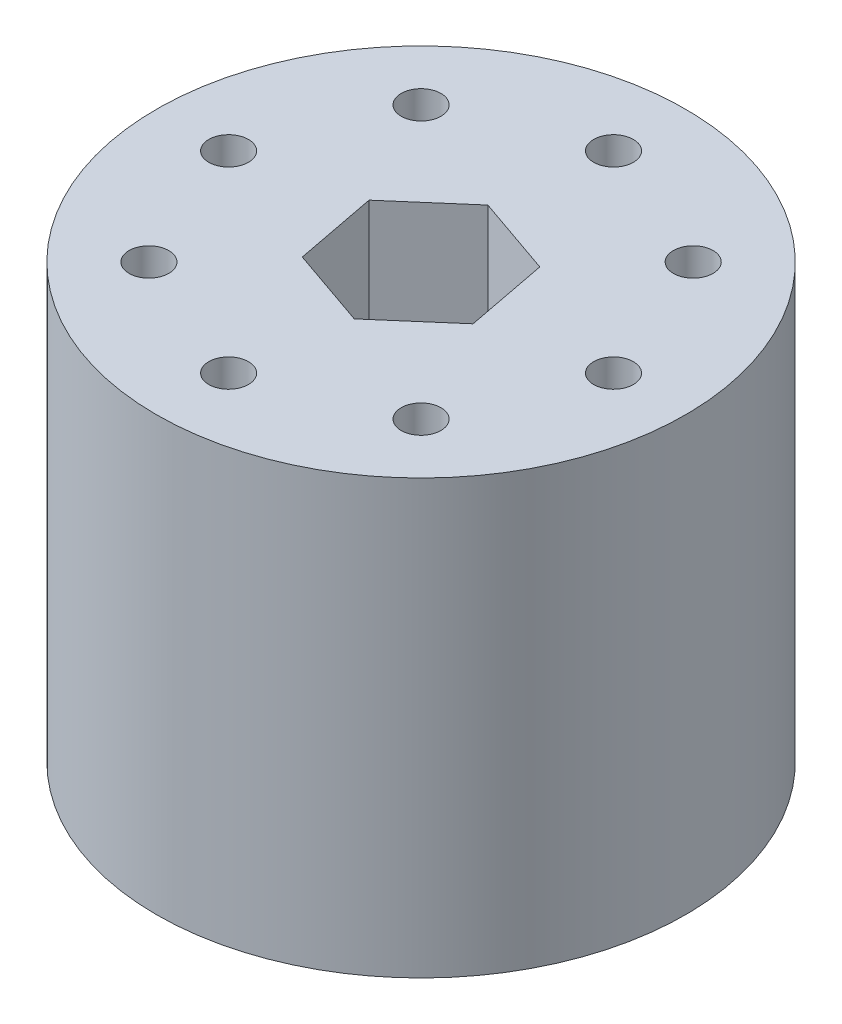
ISO-10303-21;
HEADER;
FILE_DESCRIPTION(('STEP AP214'),'2;1');
FILE_NAME('part.step','',(''),(''),'','','');
FILE_SCHEMA(('AUTOMOTIVE_DESIGN { 1 0 10303 214 1 1 1 1 }'));
ENDSEC;
DATA;
#1=APPLICATION_CONTEXT('core data for automotive mechanical design processes');
#2=APPLICATION_PROTOCOL_DEFINITION('international standard','automotive_design',2000,#1);
#3=PRODUCT_CONTEXT('',#1,'mechanical');
#4=PRODUCT('Part','Part','',(#3));
#5=PRODUCT_RELATED_PRODUCT_CATEGORY('part','',(#4));
#6=PRODUCT_DEFINITION_FORMATION('','',#4);
#7=PRODUCT_DEFINITION_CONTEXT('part definition',#1,'design');
#8=PRODUCT_DEFINITION('design','',#6,#7);
#9=PRODUCT_DEFINITION_SHAPE('','',#8);
#10=(LENGTH_UNIT() NAMED_UNIT(*) SI_UNIT(.MILLI.,.METRE.));
#11=(NAMED_UNIT(*) PLANE_ANGLE_UNIT() SI_UNIT($,.RADIAN.));
#12=(NAMED_UNIT(*) SI_UNIT($,.STERADIAN.) SOLID_ANGLE_UNIT());
#13=UNCERTAINTY_MEASURE_WITH_UNIT(LENGTH_MEASURE(1.E-05),#10,'distance_accuracy_value','');
#14=(GEOMETRIC_REPRESENTATION_CONTEXT(3) GLOBAL_UNCERTAINTY_ASSIGNED_CONTEXT((#13)) GLOBAL_UNIT_ASSIGNED_CONTEXT((#10,
#11,#12)) REPRESENTATION_CONTEXT('',''));
#15=CARTESIAN_POINT('',(0.,0.,0.));
#16=DIRECTION('',(0.,0.,1.));
#17=DIRECTION('',(1.,0.,0.));
#18=AXIS2_PLACEMENT_3D('',#15,#16,#17);
#19=CARTESIAN_POINT('',(0.,-12.,0.));
#20=DIRECTION('',(0.,1.,0.));
#21=DIRECTION('',(0.,0.,1.));
#22=AXIS2_PLACEMENT_3D('',#19,#20,#21);
#23=CYLINDRICAL_SURFACE('',#22,2.3);
#24=CARTESIAN_POINT('',(0.,26.,0.));
#25=DIRECTION('',(0.,1.,0.));
#26=DIRECTION('',(0.,0.,1.));
#27=AXIS2_PLACEMENT_3D('',#24,#25,#26);
#28=CIRCLE('',#27,2.3);
#29=CARTESIAN_POINT('',(0.,26.,2.3));
#30=VERTEX_POINT('',#29);
#31=EDGE_CURVE('E130',#30,#30,#28,.T.);
#32=ORIENTED_EDGE('',*,*,#31,.T.);
#33=EDGE_LOOP('',(#32));
#34=FACE_BOUND('',#33,.T.);
#35=CARTESIAN_POINT('',(0.,8.99999999999998,0.));
#36=DIRECTION('',(0.,-1.,0.));
#37=DIRECTION('',(0.,0.,-1.));
#38=AXIS2_PLACEMENT_3D('',#35,#36,#37);
#39=CIRCLE('',#38,2.3);
#40=CARTESIAN_POINT('',(0.,8.99999999999998,-2.3));
#41=VERTEX_POINT('',#40);
#42=EDGE_CURVE('E42',#41,#41,#39,.F.);
#43=ORIENTED_EDGE('',*,*,#42,.F.);
#44=EDGE_LOOP('',(#43));
#45=FACE_BOUND('',#44,.T.);
#46=ADVANCED_FACE('F38',(#34,#45),#23,.F.);
#47=CARTESIAN_POINT('',(0.,36.,0.));
#48=DIRECTION('',(0.,-1.,0.));
#49=DIRECTION('',(0.,0.,-1.));
#50=AXIS2_PLACEMENT_3D('',#47,#48,#49);
#51=CYLINDRICAL_SURFACE('',#50,22.);
#52=CARTESIAN_POINT('',(0.,36.,0.));
#53=DIRECTION('',(0.,1.,0.));
#54=DIRECTION('',(0.,0.,1.));
#55=AXIS2_PLACEMENT_3D('',#52,#53,#54);
#56=CIRCLE('',#55,22.);
#57=CARTESIAN_POINT('',(0.,36.,22.));
#58=VERTEX_POINT('',#57);
#59=EDGE_CURVE('E11',#58,#58,#56,.T.);
#60=ORIENTED_EDGE('',*,*,#59,.F.);
#61=EDGE_LOOP('',(#60));
#62=FACE_BOUND('',#61,.T.);
#63=CARTESIAN_POINT('',(0.,0.,0.));
#64=DIRECTION('',(0.,1.,0.));
#65=DIRECTION('',(0.,0.,1.));
#66=AXIS2_PLACEMENT_3D('',#63,#64,#65);
#67=CIRCLE('',#66,22.);
#68=CARTESIAN_POINT('',(0.,0.,22.));
#69=VERTEX_POINT('',#68);
#70=EDGE_CURVE('E47',#69,#69,#67,.T.);
#71=ORIENTED_EDGE('',*,*,#70,.T.);
#72=EDGE_LOOP('',(#71));
#73=FACE_BOUND('',#72,.T.);
#74=ADVANCED_FACE('F40',(#62,#73),#51,.T.);
#75=CARTESIAN_POINT('',(0.,36.,0.));
#76=DIRECTION('',(0.,1.,0.));
#77=DIRECTION('',(0.,0.,1.));
#78=AXIS2_PLACEMENT_3D('',#75,#76,#77);
#79=PLANE('',#78);
#80=DIRECTION('',(0.944854855791401,0.,0.327489391412012));
#81=VECTOR('',#80,1.);
#82=CARTESIAN_POINT('',(-5.29229092229886,36.,4.58166528608901));
#83=LINE('',#82,#81);
#84=CARTESIAN_POINT('',(-5.29229092229886,36.,4.58166528608901));
#85=VERTEX_POINT('',#84);
#86=CARTESIAN_POINT('',(1.32169306824095,36.,6.87409102597309));
#87=VERTEX_POINT('',#86);
#88=EDGE_CURVE('E55',#85,#87,#83,.T.);
#89=ORIENTED_EDGE('',*,*,#88,.F.);
#90=DIRECTION('',(0.188813295462993,0.,0.982013003710442));
#91=VECTOR('',#90,1.);
#92=CARTESIAN_POINT('',(-6.61398399053981,36.,-2.29242573988408));
#93=LINE('',#92,#91);
#94=CARTESIAN_POINT('',(-6.61398399053981,36.,-2.29242573988408));
#95=VERTEX_POINT('',#94);
#96=EDGE_CURVE('E139',#95,#85,#93,.T.);
#97=ORIENTED_EDGE('',*,*,#96,.F.);
#98=DIRECTION('',(-0.756041560328408,0.,0.65452361229843));
#99=VECTOR('',#98,1.);
#100=CARTESIAN_POINT('',(-1.32169306824095,36.,-6.8740910259731));
#101=LINE('',#100,#99);
#102=CARTESIAN_POINT('',(-1.32169306824095,36.,-6.8740910259731));
#103=VERTEX_POINT('',#102);
#104=EDGE_CURVE('E137',#103,#95,#101,.T.);
#105=ORIENTED_EDGE('',*,*,#104,.F.);
#106=DIRECTION('',(-0.944854855791401,0.,-0.327489391412012));
#107=VECTOR('',#106,1.);
#108=CARTESIAN_POINT('',(5.29229092229886,36.,-4.58166528608901));
#109=LINE('',#108,#107);
#110=CARTESIAN_POINT('',(5.29229092229886,36.,-4.58166528608901));
#111=VERTEX_POINT('',#110);
#112=EDGE_CURVE('E103',#111,#103,#109,.T.);
#113=ORIENTED_EDGE('',*,*,#112,.F.);
#114=DIRECTION('',(-0.188813295462993,0.,-0.982013003710442));
#115=VECTOR('',#114,1.);
#116=CARTESIAN_POINT('',(6.61398399053981,36.,2.29242573988408));
#117=LINE('',#116,#115);
#118=CARTESIAN_POINT('',(6.61398399053981,36.,2.29242573988408));
#119=VERTEX_POINT('',#118);
#120=EDGE_CURVE('E133',#119,#111,#117,.T.);
#121=ORIENTED_EDGE('',*,*,#120,.F.);
#122=DIRECTION('',(0.756041560328408,0.,-0.65452361229843));
#123=VECTOR('',#122,1.);
#124=CARTESIAN_POINT('',(1.32169306824095,36.,6.87409102597309));
#125=LINE('',#124,#123);
#126=EDGE_CURVE('E129',#87,#119,#125,.T.);
#127=ORIENTED_EDGE('',*,*,#126,.F.);
#128=EDGE_LOOP('',(#89,#97,#105,#113,#121,#127));
#129=FACE_BOUND('',#128,.T.);
#130=CARTESIAN_POINT('',(0.,36.,-16.));
#131=DIRECTION('',(0.,1.,0.));
#132=DIRECTION('',(0.,0.,1.));
#133=AXIS2_PLACEMENT_3D('',#130,#131,#132);
#134=CIRCLE('',#133,1.65000000000085);
#135=CARTESIAN_POINT('',(0.,36.,-14.3499999999991));
#136=VERTEX_POINT('',#135);
#137=EDGE_CURVE('E171',#136,#136,#134,.T.);
#138=ORIENTED_EDGE('',*,*,#137,.F.);
#139=EDGE_LOOP('',(#138));
#140=FACE_BOUND('',#139,.T.);
#141=CARTESIAN_POINT('',(11.3137084989847,36.,-11.3137084989847));
#142=DIRECTION('',(0.,1.,0.));
#143=DIRECTION('',(0.,0.,1.));
#144=AXIS2_PLACEMENT_3D('',#141,#142,#143);
#145=CIRCLE('',#144,1.65000000000154);
#146=CARTESIAN_POINT('',(11.3137084989847,36.,-9.6637084989832));
#147=VERTEX_POINT('',#146);
#148=EDGE_CURVE('E177',#147,#147,#145,.T.);
#149=ORIENTED_EDGE('',*,*,#148,.F.);
#150=EDGE_LOOP('',(#149));
#151=FACE_BOUND('',#150,.T.);
#152=CARTESIAN_POINT('',(16.,36.,0.));
#153=DIRECTION('',(0.,1.,0.));
#154=DIRECTION('',(0.,0.,1.));
#155=AXIS2_PLACEMENT_3D('',#152,#153,#154);
#156=CIRCLE('',#155,1.6500000000012);
#157=CARTESIAN_POINT('',(16.,36.,1.6500000000012));
#158=VERTEX_POINT('',#157);
#159=EDGE_CURVE('E183',#158,#158,#156,.T.);
#160=ORIENTED_EDGE('',*,*,#159,.F.);
#161=EDGE_LOOP('',(#160));
#162=FACE_BOUND('',#161,.T.);
#163=CARTESIAN_POINT('',(11.3137084989856,36.,11.3137084989857));
#164=DIRECTION('',(0.,1.,0.));
#165=DIRECTION('',(0.,0.,1.));
#166=AXIS2_PLACEMENT_3D('',#163,#164,#165);
#167=CIRCLE('',#166,1.65000000000003);
#168=CARTESIAN_POINT('',(11.3137084989856,36.,12.9637084989858));
#169=VERTEX_POINT('',#168);
#170=EDGE_CURVE('E152',#169,#169,#167,.T.);
#171=ORIENTED_EDGE('',*,*,#170,.F.);
#172=EDGE_LOOP('',(#171));
#173=FACE_BOUND('',#172,.T.);
#174=CARTESIAN_POINT('',(9.05525654459922E-13,36.,16.000000000001));
#175=DIRECTION('',(0.,1.,0.));
#176=DIRECTION('',(0.,0.,1.));
#177=AXIS2_PLACEMENT_3D('',#174,#175,#176);
#178=CIRCLE('',#177,1.65);
#179=CARTESIAN_POINT('',(9.05525654459922E-13,36.,17.650000000001));
#180=VERTEX_POINT('',#179);
#181=EDGE_CURVE('E153',#180,#180,#178,.T.);
#182=ORIENTED_EDGE('',*,*,#181,.F.);
#183=EDGE_LOOP('',(#182));
#184=FACE_BOUND('',#183,.T.);
#185=CARTESIAN_POINT('',(-11.3137084989847,36.,11.3137084989847));
#186=DIRECTION('',(0.,1.,0.));
#187=DIRECTION('',(0.,0.,1.));
#188=AXIS2_PLACEMENT_3D('',#185,#186,#187);
#189=CIRCLE('',#188,1.64999999999989);
#190=CARTESIAN_POINT('',(-11.3137084989847,36.,12.9637084989846));
#191=VERTEX_POINT('',#190);
#192=EDGE_CURVE('E159',#191,#191,#189,.T.);
#193=ORIENTED_EDGE('',*,*,#192,.F.);
#194=EDGE_LOOP('',(#193));
#195=FACE_BOUND('',#194,.T.);
#196=CARTESIAN_POINT('',(-16.,36.,0.));
#197=DIRECTION('',(0.,1.,0.));
#198=DIRECTION('',(0.,0.,1.));
#199=AXIS2_PLACEMENT_3D('',#196,#197,#198);
#200=CIRCLE('',#199,1.65000000000023);
#201=CARTESIAN_POINT('',(-16.,36.,1.65000000000023));
#202=VERTEX_POINT('',#201);
#203=EDGE_CURVE('E143',#202,#202,#200,.T.);
#204=ORIENTED_EDGE('',*,*,#203,.F.);
#205=EDGE_LOOP('',(#204));
#206=FACE_BOUND('',#205,.T.);
#207=CARTESIAN_POINT('',(-11.3137084989847,36.,-11.3137084989847));
#208=DIRECTION('',(0.,1.,0.));
#209=DIRECTION('',(0.,0.,1.));
#210=AXIS2_PLACEMENT_3D('',#207,#208,#209);
#211=CIRCLE('',#210,1.65000000000082);
#212=CARTESIAN_POINT('',(-11.3137084989847,36.,-9.66370849898391));
#213=VERTEX_POINT('',#212);
#214=EDGE_CURVE('E170',#213,#213,#211,.T.);
#215=ORIENTED_EDGE('',*,*,#214,.F.);
#216=EDGE_LOOP('',(#215));
#217=FACE_BOUND('',#216,.T.);
#218=ORIENTED_EDGE('',*,*,#59,.T.);
#219=EDGE_LOOP('',(#218));
#220=FACE_BOUND('',#219,.T.);
#221=ADVANCED_FACE('F202',(#129,#140,#151,#162,#173,#184,#195,#206,#217,#220),#79,.T.);
#222=CARTESIAN_POINT('',(0.,0.,0.));
#223=DIRECTION('',(0.,1.,0.));
#224=DIRECTION('',(0.,0.,1.));
#225=AXIS2_PLACEMENT_3D('',#222,#223,#224);
#226=PLANE('',#225);
#227=CARTESIAN_POINT('',(0.,0.,0.));
#228=DIRECTION('',(0.,-1.,0.));
#229=DIRECTION('',(0.,0.,-1.));
#230=AXIS2_PLACEMENT_3D('',#227,#228,#229);
#231=CIRCLE('',#230,5.59540043034474);
#232=CARTESIAN_POINT('',(0.,0.,-5.59540043034474));
#233=VERTEX_POINT('',#232);
#234=EDGE_CURVE('E434',#233,#233,#231,.T.);
#235=ORIENTED_EDGE('',*,*,#234,.F.);
#236=EDGE_LOOP('',(#235));
#237=FACE_BOUND('',#236,.T.);
#238=CARTESIAN_POINT('',(0.,0.,-16.));
#239=DIRECTION('',(0.,1.,0.));
#240=DIRECTION('',(0.,0.,1.));
#241=AXIS2_PLACEMENT_3D('',#238,#239,#240);
#242=CIRCLE('',#241,1.65000000000085);
#243=CARTESIAN_POINT('',(0.,0.,-14.3499999999991));
#244=VERTEX_POINT('',#243);
#245=EDGE_CURVE('E167',#244,#244,#242,.T.);
#246=ORIENTED_EDGE('',*,*,#245,.T.);
#247=EDGE_LOOP('',(#246));
#248=FACE_BOUND('',#247,.T.);
#249=CARTESIAN_POINT('',(11.3137084989847,0.,-11.3137084989847));
#250=DIRECTION('',(0.,1.,0.));
#251=DIRECTION('',(0.,0.,1.));
#252=AXIS2_PLACEMENT_3D('',#249,#250,#251);
#253=CIRCLE('',#252,1.65000000000154);
#254=CARTESIAN_POINT('',(11.3137084989847,0.,-9.6637084989832));
#255=VERTEX_POINT('',#254);
#256=EDGE_CURVE('E174',#255,#255,#253,.T.);
#257=ORIENTED_EDGE('',*,*,#256,.T.);
#258=EDGE_LOOP('',(#257));
#259=FACE_BOUND('',#258,.T.);
#260=CARTESIAN_POINT('',(16.,0.,0.));
#261=DIRECTION('',(0.,1.,0.));
#262=DIRECTION('',(0.,0.,1.));
#263=AXIS2_PLACEMENT_3D('',#260,#261,#262);
#264=CIRCLE('',#263,1.6500000000012);
#265=CARTESIAN_POINT('',(16.,0.,1.6500000000012));
#266=VERTEX_POINT('',#265);
#267=EDGE_CURVE('E180',#266,#266,#264,.T.);
#268=ORIENTED_EDGE('',*,*,#267,.T.);
#269=EDGE_LOOP('',(#268));
#270=FACE_BOUND('',#269,.T.);
#271=CARTESIAN_POINT('',(11.3137084989856,0.,11.3137084989857));
#272=DIRECTION('',(0.,1.,0.));
#273=DIRECTION('',(0.,0.,1.));
#274=AXIS2_PLACEMENT_3D('',#271,#272,#273);
#275=CIRCLE('',#274,1.65000000000003);
#276=CARTESIAN_POINT('',(11.3137084989856,0.,12.9637084989858));
#277=VERTEX_POINT('',#276);
#278=EDGE_CURVE('E186',#277,#277,#275,.T.);
#279=ORIENTED_EDGE('',*,*,#278,.T.);
#280=EDGE_LOOP('',(#279));
#281=FACE_BOUND('',#280,.T.);
#282=CARTESIAN_POINT('',(9.05525654459922E-13,0.,16.000000000001));
#283=DIRECTION('',(0.,1.,0.));
#284=DIRECTION('',(0.,0.,1.));
#285=AXIS2_PLACEMENT_3D('',#282,#283,#284);
#286=CIRCLE('',#285,1.65);
#287=CARTESIAN_POINT('',(9.05525654459922E-13,0.,17.650000000001));
#288=VERTEX_POINT('',#287);
#289=EDGE_CURVE('E149',#288,#288,#286,.T.);
#290=ORIENTED_EDGE('',*,*,#289,.T.);
#291=EDGE_LOOP('',(#290));
#292=FACE_BOUND('',#291,.T.);
#293=CARTESIAN_POINT('',(-11.3137084989847,0.,11.3137084989847));
#294=DIRECTION('',(0.,1.,0.));
#295=DIRECTION('',(0.,0.,1.));
#296=AXIS2_PLACEMENT_3D('',#293,#294,#295);
#297=CIRCLE('',#296,1.64999999999989);
#298=CARTESIAN_POINT('',(-11.3137084989847,0.,12.9637084989846));
#299=VERTEX_POINT('',#298);
#300=EDGE_CURVE('E156',#299,#299,#297,.T.);
#301=ORIENTED_EDGE('',*,*,#300,.T.);
#302=EDGE_LOOP('',(#301));
#303=FACE_BOUND('',#302,.T.);
#304=CARTESIAN_POINT('',(-16.,0.,0.));
#305=DIRECTION('',(0.,1.,0.));
#306=DIRECTION('',(0.,0.,1.));
#307=AXIS2_PLACEMENT_3D('',#304,#305,#306);
#308=CIRCLE('',#307,1.65000000000023);
#309=CARTESIAN_POINT('',(-16.,0.,1.65000000000023));
#310=VERTEX_POINT('',#309);
#311=EDGE_CURVE('E162',#310,#310,#308,.T.);
#312=ORIENTED_EDGE('',*,*,#311,.T.);
#313=EDGE_LOOP('',(#312));
#314=FACE_BOUND('',#313,.T.);
#315=CARTESIAN_POINT('',(-11.3137084989847,0.,-11.3137084989847));
#316=DIRECTION('',(0.,1.,0.));
#317=DIRECTION('',(0.,0.,1.));
#318=AXIS2_PLACEMENT_3D('',#315,#316,#317);
#319=CIRCLE('',#318,1.65000000000082);
#320=CARTESIAN_POINT('',(-11.3137084989847,0.,-9.66370849898391));
#321=VERTEX_POINT('',#320);
#322=EDGE_CURVE('E191',#321,#321,#319,.T.);
#323=ORIENTED_EDGE('',*,*,#322,.T.);
#324=EDGE_LOOP('',(#323));
#325=FACE_BOUND('',#324,.T.);
#326=ORIENTED_EDGE('',*,*,#70,.F.);
#327=EDGE_LOOP('',(#326));
#328=FACE_BOUND('',#327,.T.);
#329=ADVANCED_FACE('F199',(#237,#248,#259,#270,#281,#292,#303,#314,#325,#328),#226,.F.);
#330=CARTESIAN_POINT('',(-11.3137084989847,0.,-11.3137084989847));
#331=DIRECTION('',(0.,1.,0.));
#332=DIRECTION('',(0.,0.,1.));
#333=AXIS2_PLACEMENT_3D('',#330,#331,#332);
#334=CYLINDRICAL_SURFACE('',#333,1.65000000000082);
#335=ORIENTED_EDGE('',*,*,#322,.F.);
#336=EDGE_LOOP('',(#335));
#337=FACE_BOUND('',#336,.T.);
#338=ORIENTED_EDGE('',*,*,#214,.T.);
#339=EDGE_LOOP('',(#338));
#340=FACE_BOUND('',#339,.T.);
#341=ADVANCED_FACE('F201',(#337,#340),#334,.F.);
#342=CARTESIAN_POINT('',(-16.,0.,0.));
#343=DIRECTION('',(0.,1.,0.));
#344=DIRECTION('',(0.,0.,1.));
#345=AXIS2_PLACEMENT_3D('',#342,#343,#344);
#346=CYLINDRICAL_SURFACE('',#345,1.65000000000023);
#347=ORIENTED_EDGE('',*,*,#311,.F.);
#348=EDGE_LOOP('',(#347));
#349=FACE_BOUND('',#348,.T.);
#350=ORIENTED_EDGE('',*,*,#203,.T.);
#351=EDGE_LOOP('',(#350));
#352=FACE_BOUND('',#351,.T.);
#353=ADVANCED_FACE('F209',(#349,#352),#346,.F.);
#354=CARTESIAN_POINT('',(-11.3137084989847,0.,11.3137084989847));
#355=DIRECTION('',(0.,1.,0.));
#356=DIRECTION('',(0.,0.,1.));
#357=AXIS2_PLACEMENT_3D('',#354,#355,#356);
#358=CYLINDRICAL_SURFACE('',#357,1.64999999999989);
#359=ORIENTED_EDGE('',*,*,#300,.F.);
#360=EDGE_LOOP('',(#359));
#361=FACE_BOUND('',#360,.T.);
#362=ORIENTED_EDGE('',*,*,#192,.T.);
#363=EDGE_LOOP('',(#362));
#364=FACE_BOUND('',#363,.T.);
#365=ADVANCED_FACE('F256',(#361,#364),#358,.F.);
#366=CARTESIAN_POINT('',(9.05525654459922E-13,0.,16.000000000001));
#367=DIRECTION('',(0.,1.,0.));
#368=DIRECTION('',(0.,0.,1.));
#369=AXIS2_PLACEMENT_3D('',#366,#367,#368);
#370=CYLINDRICAL_SURFACE('',#369,1.65);
#371=ORIENTED_EDGE('',*,*,#289,.F.);
#372=EDGE_LOOP('',(#371));
#373=FACE_BOUND('',#372,.T.);
#374=ORIENTED_EDGE('',*,*,#181,.T.);
#375=EDGE_LOOP('',(#374));
#376=FACE_BOUND('',#375,.T.);
#377=ADVANCED_FACE('F252',(#373,#376),#370,.F.);
#378=CARTESIAN_POINT('',(11.3137084989856,0.,11.3137084989857));
#379=DIRECTION('',(0.,1.,0.));
#380=DIRECTION('',(0.,0.,1.));
#381=AXIS2_PLACEMENT_3D('',#378,#379,#380);
#382=CYLINDRICAL_SURFACE('',#381,1.65000000000003);
#383=ORIENTED_EDGE('',*,*,#278,.F.);
#384=EDGE_LOOP('',(#383));
#385=FACE_BOUND('',#384,.T.);
#386=ORIENTED_EDGE('',*,*,#170,.T.);
#387=EDGE_LOOP('',(#386));
#388=FACE_BOUND('',#387,.T.);
#389=ADVANCED_FACE('F255',(#385,#388),#382,.F.);
#390=CARTESIAN_POINT('',(16.,0.,0.));
#391=DIRECTION('',(0.,1.,0.));
#392=DIRECTION('',(0.,0.,1.));
#393=AXIS2_PLACEMENT_3D('',#390,#391,#392);
#394=CYLINDRICAL_SURFACE('',#393,1.6500000000012);
#395=ORIENTED_EDGE('',*,*,#267,.F.);
#396=EDGE_LOOP('',(#395));
#397=FACE_BOUND('',#396,.T.);
#398=ORIENTED_EDGE('',*,*,#159,.T.);
#399=EDGE_LOOP('',(#398));
#400=FACE_BOUND('',#399,.T.);
#401=ADVANCED_FACE('F270',(#397,#400),#394,.F.);
#402=CARTESIAN_POINT('',(11.3137084989847,0.,-11.3137084989847));
#403=DIRECTION('',(0.,1.,0.));
#404=DIRECTION('',(0.,0.,1.));
#405=AXIS2_PLACEMENT_3D('',#402,#403,#404);
#406=CYLINDRICAL_SURFACE('',#405,1.65000000000154);
#407=ORIENTED_EDGE('',*,*,#256,.F.);
#408=EDGE_LOOP('',(#407));
#409=FACE_BOUND('',#408,.T.);
#410=ORIENTED_EDGE('',*,*,#148,.T.);
#411=EDGE_LOOP('',(#410));
#412=FACE_BOUND('',#411,.T.);
#413=ADVANCED_FACE('F266',(#409,#412),#406,.F.);
#414=CARTESIAN_POINT('',(0.,0.,-16.));
#415=DIRECTION('',(0.,1.,0.));
#416=DIRECTION('',(0.,0.,1.));
#417=AXIS2_PLACEMENT_3D('',#414,#415,#416);
#418=CYLINDRICAL_SURFACE('',#417,1.65000000000085);
#419=ORIENTED_EDGE('',*,*,#245,.F.);
#420=EDGE_LOOP('',(#419));
#421=FACE_BOUND('',#420,.T.);
#422=ORIENTED_EDGE('',*,*,#137,.T.);
#423=EDGE_LOOP('',(#422));
#424=FACE_BOUND('',#423,.T.);
#425=ADVANCED_FACE('F251',(#421,#424),#418,.F.);
#426=CARTESIAN_POINT('',(-5.29229092229886,26.,4.58166528608901));
#427=DIRECTION('',(-0.327489391412012,0.,0.944854855791401));
#428=DIRECTION('',(0.944854855791401,0.,0.327489391412012));
#429=AXIS2_PLACEMENT_3D('',#426,#427,#428);
#430=PLANE('',#429);
#431=ORIENTED_EDGE('',*,*,#88,.T.);
#432=DIRECTION('',(0.,1.,0.));
#433=VECTOR('',#432,1.);
#434=CARTESIAN_POINT('',(1.32169306824095,26.,6.87409102597309));
#435=LINE('',#434,#433);
#436=CARTESIAN_POINT('',(1.32169306824095,26.,6.87409102597309));
#437=VERTEX_POINT('',#436);
#438=EDGE_CURVE('E85',#437,#87,#435,.T.);
#439=ORIENTED_EDGE('',*,*,#438,.F.);
#440=DIRECTION('',(0.944854855791401,0.,0.327489391412012));
#441=VECTOR('',#440,1.);
#442=CARTESIAN_POINT('',(-5.29229092229886,26.,4.58166528608901));
#443=LINE('',#442,#441);
#444=CARTESIAN_POINT('',(-5.29229092229886,26.,4.58166528608901));
#445=VERTEX_POINT('',#444);
#446=EDGE_CURVE('E141',#445,#437,#443,.T.);
#447=ORIENTED_EDGE('',*,*,#446,.F.);
#448=DIRECTION('',(0.,1.,0.));
#449=VECTOR('',#448,1.);
#450=CARTESIAN_POINT('',(-5.29229092229886,26.,4.58166528608901));
#451=LINE('',#450,#449);
#452=EDGE_CURVE('E63',#445,#85,#451,.T.);
#453=ORIENTED_EDGE('',*,*,#452,.T.);
#454=EDGE_LOOP('',(#431,#439,#447,#453));
#455=FACE_BOUND('',#454,.T.);
#456=ADVANCED_FACE('F237',(#455),#430,.F.);
#457=CARTESIAN_POINT('',(-6.61398399053981,26.,-2.29242573988408));
#458=DIRECTION('',(-0.982013003710442,0.,0.188813295462993));
#459=DIRECTION('',(0.188813295462993,0.,0.982013003710442));
#460=AXIS2_PLACEMENT_3D('',#457,#458,#459);
#461=PLANE('',#460);
#462=ORIENTED_EDGE('',*,*,#96,.T.);
#463=ORIENTED_EDGE('',*,*,#452,.F.);
#464=DIRECTION('',(0.188813295462993,0.,0.982013003710442));
#465=VECTOR('',#464,1.);
#466=CARTESIAN_POINT('',(-6.61398399053981,26.,-2.29242573988408));
#467=LINE('',#466,#465);
#468=CARTESIAN_POINT('',(-6.61398399053981,26.,-2.29242573988408));
#469=VERTEX_POINT('',#468);
#470=EDGE_CURVE('E115',#469,#445,#467,.T.);
#471=ORIENTED_EDGE('',*,*,#470,.F.);
#472=DIRECTION('',(0.,1.,0.));
#473=VECTOR('',#472,1.);
#474=CARTESIAN_POINT('',(-6.61398399053981,26.,-2.29242573988408));
#475=LINE('',#474,#473);
#476=EDGE_CURVE('E107',#469,#95,#475,.T.);
#477=ORIENTED_EDGE('',*,*,#476,.T.);
#478=EDGE_LOOP('',(#462,#463,#471,#477));
#479=FACE_BOUND('',#478,.T.);
#480=ADVANCED_FACE('F234',(#479),#461,.F.);
#481=CARTESIAN_POINT('',(-1.32169306824095,26.,-6.8740910259731));
#482=DIRECTION('',(-0.65452361229843,0.,-0.756041560328408));
#483=DIRECTION('',(-0.756041560328408,0.,0.65452361229843));
#484=AXIS2_PLACEMENT_3D('',#481,#482,#483);
#485=PLANE('',#484);
#486=ORIENTED_EDGE('',*,*,#104,.T.);
#487=ORIENTED_EDGE('',*,*,#476,.F.);
#488=DIRECTION('',(-0.756041560328408,0.,0.65452361229843));
#489=VECTOR('',#488,1.);
#490=CARTESIAN_POINT('',(-1.32169306824095,26.,-6.8740910259731));
#491=LINE('',#490,#489);
#492=CARTESIAN_POINT('',(-1.32169306824095,26.,-6.8740910259731));
#493=VERTEX_POINT('',#492);
#494=EDGE_CURVE('E111',#493,#469,#491,.T.);
#495=ORIENTED_EDGE('',*,*,#494,.F.);
#496=DIRECTION('',(0.,1.,0.));
#497=VECTOR('',#496,1.);
#498=CARTESIAN_POINT('',(-1.32169306824095,26.,-6.8740910259731));
#499=LINE('',#498,#497);
#500=EDGE_CURVE('E96',#493,#103,#499,.T.);
#501=ORIENTED_EDGE('',*,*,#500,.T.);
#502=EDGE_LOOP('',(#486,#487,#495,#501));
#503=FACE_BOUND('',#502,.T.);
#504=ADVANCED_FACE('F112',(#503),#485,.F.);
#505=CARTESIAN_POINT('',(5.29229092229886,26.,-4.58166528608901));
#506=DIRECTION('',(0.327489391412012,0.,-0.944854855791401));
#507=DIRECTION('',(-0.944854855791401,0.,-0.327489391412012));
#508=AXIS2_PLACEMENT_3D('',#505,#506,#507);
#509=PLANE('',#508);
#510=ORIENTED_EDGE('',*,*,#112,.T.);
#511=ORIENTED_EDGE('',*,*,#500,.F.);
#512=DIRECTION('',(-0.944854855791401,0.,-0.327489391412012));
#513=VECTOR('',#512,1.);
#514=CARTESIAN_POINT('',(5.29229092229886,26.,-4.58166528608901));
#515=LINE('',#514,#513);
#516=CARTESIAN_POINT('',(5.29229092229886,26.,-4.58166528608901));
#517=VERTEX_POINT('',#516);
#518=EDGE_CURVE('E100',#517,#493,#515,.T.);
#519=ORIENTED_EDGE('',*,*,#518,.F.);
#520=DIRECTION('',(0.,1.,0.));
#521=VECTOR('',#520,1.);
#522=CARTESIAN_POINT('',(5.29229092229886,26.,-4.58166528608901));
#523=LINE('',#522,#521);
#524=EDGE_CURVE('E108',#517,#111,#523,.T.);
#525=ORIENTED_EDGE('',*,*,#524,.T.);
#526=EDGE_LOOP('',(#510,#511,#519,#525));
#527=FACE_BOUND('',#526,.T.);
#528=ADVANCED_FACE('F98',(#527),#509,.F.);
#529=CARTESIAN_POINT('',(6.61398399053981,26.,2.29242573988408));
#530=DIRECTION('',(0.982013003710442,0.,-0.188813295462993));
#531=DIRECTION('',(-0.188813295462993,0.,-0.982013003710442));
#532=AXIS2_PLACEMENT_3D('',#529,#530,#531);
#533=PLANE('',#532);
#534=ORIENTED_EDGE('',*,*,#120,.T.);
#535=ORIENTED_EDGE('',*,*,#524,.F.);
#536=DIRECTION('',(-0.188813295462993,0.,-0.982013003710442));
#537=VECTOR('',#536,1.);
#538=CARTESIAN_POINT('',(6.61398399053981,26.,2.29242573988408));
#539=LINE('',#538,#537);
#540=CARTESIAN_POINT('',(6.61398399053981,26.,2.29242573988408));
#541=VERTEX_POINT('',#540);
#542=EDGE_CURVE('E121',#541,#517,#539,.T.);
#543=ORIENTED_EDGE('',*,*,#542,.F.);
#544=DIRECTION('',(0.,1.,0.));
#545=VECTOR('',#544,1.);
#546=CARTESIAN_POINT('',(6.61398399053981,26.,2.29242573988408));
#547=LINE('',#546,#545);
#548=EDGE_CURVE('E146',#541,#119,#547,.T.);
#549=ORIENTED_EDGE('',*,*,#548,.T.);
#550=EDGE_LOOP('',(#534,#535,#543,#549));
#551=FACE_BOUND('',#550,.T.);
#552=ADVANCED_FACE('F242',(#551),#533,.F.);
#553=CARTESIAN_POINT('',(1.32169306824095,26.,6.87409102597309));
#554=DIRECTION('',(0.65452361229843,0.,0.756041560328408));
#555=DIRECTION('',(0.756041560328409,0.,-0.65452361229843));
#556=AXIS2_PLACEMENT_3D('',#553,#554,#555);
#557=PLANE('',#556);
#558=ORIENTED_EDGE('',*,*,#126,.T.);
#559=ORIENTED_EDGE('',*,*,#548,.F.);
#560=DIRECTION('',(0.756041560328408,0.,-0.65452361229843));
#561=VECTOR('',#560,1.);
#562=CARTESIAN_POINT('',(1.32169306824095,26.,6.87409102597309));
#563=LINE('',#562,#561);
#564=EDGE_CURVE('E123',#437,#541,#563,.T.);
#565=ORIENTED_EDGE('',*,*,#564,.F.);
#566=ORIENTED_EDGE('',*,*,#438,.T.);
#567=EDGE_LOOP('',(#558,#559,#565,#566));
#568=FACE_BOUND('',#567,.T.);
#569=ADVANCED_FACE('F232',(#568),#557,.F.);
#570=CARTESIAN_POINT('',(0.,26.,0.));
#571=DIRECTION('',(0.,1.,0.));
#572=DIRECTION('',(0.,0.,1.));
#573=AXIS2_PLACEMENT_3D('',#570,#571,#572);
#574=PLANE('',#573);
#575=ORIENTED_EDGE('',*,*,#31,.F.);
#576=EDGE_LOOP('',(#575));
#577=FACE_BOUND('',#576,.T.);
#578=ORIENTED_EDGE('',*,*,#446,.T.);
#579=ORIENTED_EDGE('',*,*,#564,.T.);
#580=ORIENTED_EDGE('',*,*,#542,.T.);
#581=ORIENTED_EDGE('',*,*,#518,.T.);
#582=ORIENTED_EDGE('',*,*,#494,.T.);
#583=ORIENTED_EDGE('',*,*,#470,.T.);
#584=EDGE_LOOP('',(#578,#579,#580,#581,#582,#583));
#585=FACE_BOUND('',#584,.T.);
#586=ADVANCED_FACE('F118',(#577,#585),#574,.T.);
#587=CARTESIAN_POINT('',(0.,8.99999999999998,0.));
#588=DIRECTION('',(0.,-1.,0.));
#589=DIRECTION('',(0.,0.,-1.));
#590=AXIS2_PLACEMENT_3D('',#587,#588,#589);
#591=PLANE('',#590);
#592=CARTESIAN_POINT('',(0.,8.99999999999998,0.));
#593=DIRECTION('',(0.,-1.,0.));
#594=DIRECTION('',(0.,0.,-1.));
#595=AXIS2_PLACEMENT_3D('',#592,#593,#594);
#596=CIRCLE('',#595,5.59540043034474);
#597=CARTESIAN_POINT('',(0.,8.99999999999998,-5.59540043034474));
#598=VERTEX_POINT('',#597);
#599=EDGE_CURVE('E432',#598,#598,#596,.T.);
#600=ORIENTED_EDGE('',*,*,#599,.T.);
#601=EDGE_LOOP('',(#600));
#602=FACE_BOUND('',#601,.T.);
#603=ORIENTED_EDGE('',*,*,#42,.T.);
#604=EDGE_LOOP('',(#603));
#605=FACE_BOUND('',#604,.T.);
#606=ADVANCED_FACE('F231',(#602,#605),#591,.T.);
#607=CARTESIAN_POINT('',(0.,8.99999999999998,0.));
#608=DIRECTION('',(0.,-1.,0.));
#609=DIRECTION('',(0.,0.,-1.));
#610=AXIS2_PLACEMENT_3D('',#607,#608,#609);
#611=CYLINDRICAL_SURFACE('',#610,5.59540043034474);
#612=ORIENTED_EDGE('',*,*,#599,.F.);
#613=EDGE_LOOP('',(#612));
#614=FACE_BOUND('',#613,.T.);
#615=ORIENTED_EDGE('',*,*,#234,.T.);
#616=EDGE_LOOP('',(#615));
#617=FACE_BOUND('',#616,.T.);
#618=ADVANCED_FACE('F227',(#614,#617),#611,.F.);
#619=CLOSED_SHELL('',(#46,#74,#221,#329,#341,#353,#365,#377,#389,#401,#413,#425,#456,#480,#504,
#528,#552,#569,#586,#606,#618));
#620=MANIFOLD_SOLID_BREP('B2',#619);
#621=ADVANCED_BREP_SHAPE_REPRESENTATION('',(#18,#620),#14);
#622=SHAPE_DEFINITION_REPRESENTATION(#9,#621);
ENDSEC;
END-ISO-10303-21;
